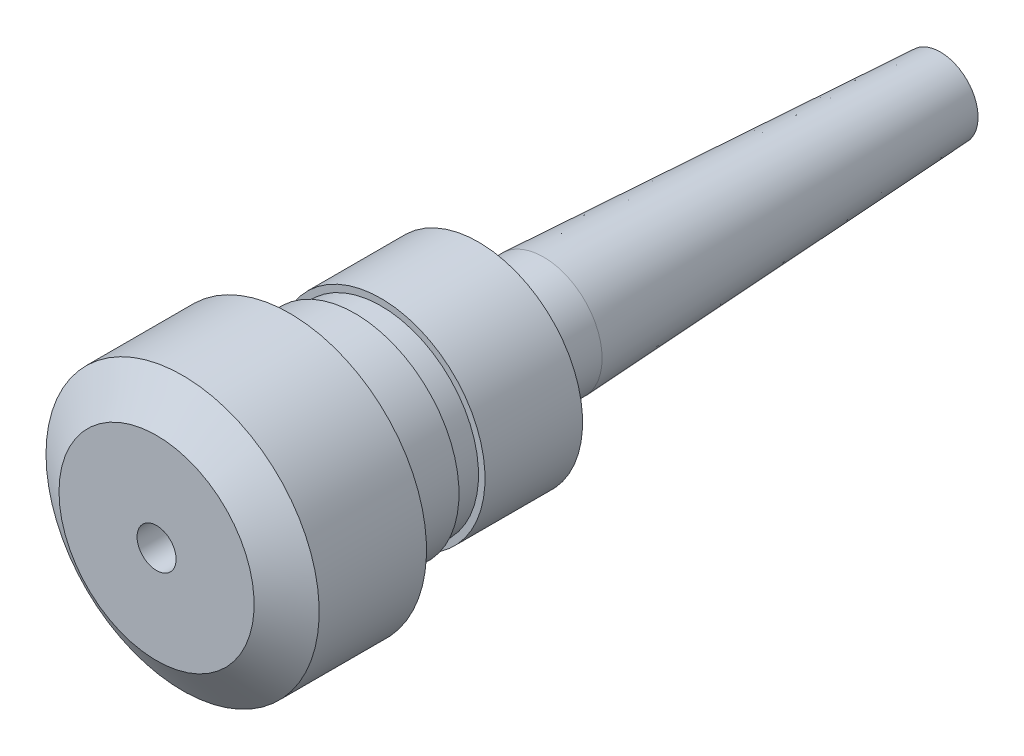
ISO-10303-21;
HEADER;
FILE_DESCRIPTION(('STEP AP214'),'2;1');
FILE_NAME('part.step','',(''),(''),'','','');
FILE_SCHEMA(('AUTOMOTIVE_DESIGN { 1 0 10303 214 1 1 1 1 }'));
ENDSEC;
DATA;
#1=APPLICATION_CONTEXT('core data for automotive mechanical design processes');
#2=APPLICATION_PROTOCOL_DEFINITION('international standard','automotive_design',2000,#1);
#3=PRODUCT_CONTEXT('',#1,'mechanical');
#4=PRODUCT('Part','Part','',(#3));
#5=PRODUCT_RELATED_PRODUCT_CATEGORY('part','',(#4));
#6=PRODUCT_DEFINITION_FORMATION('','',#4);
#7=PRODUCT_DEFINITION_CONTEXT('part definition',#1,'design');
#8=PRODUCT_DEFINITION('design','',#6,#7);
#9=PRODUCT_DEFINITION_SHAPE('','',#8);
#10=(LENGTH_UNIT() NAMED_UNIT(*) SI_UNIT(.MILLI.,.METRE.));
#11=(NAMED_UNIT(*) PLANE_ANGLE_UNIT() SI_UNIT($,.RADIAN.));
#12=(NAMED_UNIT(*) SI_UNIT($,.STERADIAN.) SOLID_ANGLE_UNIT());
#13=UNCERTAINTY_MEASURE_WITH_UNIT(LENGTH_MEASURE(1.E-05),#10,'distance_accuracy_value','');
#14=(GEOMETRIC_REPRESENTATION_CONTEXT(3) GLOBAL_UNCERTAINTY_ASSIGNED_CONTEXT((#13)) GLOBAL_UNIT_ASSIGNED_CONTEXT((#10,
#11,#12)) REPRESENTATION_CONTEXT('',''));
#15=CARTESIAN_POINT('',(0.,0.,0.));
#16=DIRECTION('',(0.,0.,1.));
#17=DIRECTION('',(1.,0.,0.));
#18=AXIS2_PLACEMENT_3D('',#15,#16,#17);
#19=CARTESIAN_POINT('',(16.,0.,-49.5));
#20=DIRECTION('',(0.,0.,1.));
#21=DIRECTION('',(1.,0.,0.));
#22=AXIS2_PLACEMENT_3D('',#19,#20,#21);
#23=PLANE('',#22);
#24=CARTESIAN_POINT('',(0.,0.,-49.5));
#25=DIRECTION('',(0.,0.,-1.));
#26=DIRECTION('',(-1.,0.,0.));
#27=AXIS2_PLACEMENT_3D('',#24,#25,#26);
#28=CIRCLE('',#27,16.);
#29=CARTESIAN_POINT('',(-16.,0.,-49.5));
#30=VERTEX_POINT('',#29);
#31=EDGE_CURVE('E65',#30,#30,#28,.T.);
#32=ORIENTED_EDGE('',*,*,#31,.T.);
#33=EDGE_LOOP('',(#32));
#34=FACE_BOUND('',#33,.T.);
#35=CARTESIAN_POINT('',(0.,0.,-49.5));
#36=DIRECTION('',(0.,0.,1.));
#37=DIRECTION('',(1.,0.,0.));
#38=AXIS2_PLACEMENT_3D('',#35,#36,#37);
#39=CIRCLE('',#38,9.);
#40=CARTESIAN_POINT('',(9.,0.,-49.5));
#41=VERTEX_POINT('',#40);
#42=EDGE_CURVE('E10',#41,#41,#39,.F.);
#43=ORIENTED_EDGE('',*,*,#42,.F.);
#44=EDGE_LOOP('',(#43));
#45=FACE_BOUND('',#44,.T.);
#46=ADVANCED_FACE('F33',(#34,#45),#23,.F.);
#47=CARTESIAN_POINT('',(0.,0.,0.));
#48=DIRECTION('',(0.,0.,-1.));
#49=DIRECTION('',(-1.,0.,0.));
#50=AXIS2_PLACEMENT_3D('',#47,#48,#49);
#51=CONICAL_SURFACE('',#50,15.,0.982793723247329);
#52=CARTESIAN_POINT('',(0.,0.,-4.));
#53=DIRECTION('',(0.,0.,-1.));
#54=DIRECTION('',(-1.,0.,0.));
#55=AXIS2_PLACEMENT_3D('',#52,#53,#54);
#56=CIRCLE('',#55,21.);
#57=CARTESIAN_POINT('',(-21.,0.,-4.));
#58=VERTEX_POINT('',#57);
#59=EDGE_CURVE('E40',#58,#58,#56,.T.);
#60=ORIENTED_EDGE('',*,*,#59,.F.);
#61=EDGE_LOOP('',(#60));
#62=FACE_BOUND('',#61,.T.);
#63=CARTESIAN_POINT('',(0.,0.,0.));
#64=DIRECTION('',(0.,0.,-1.));
#65=DIRECTION('',(-1.,0.,0.));
#66=AXIS2_PLACEMENT_3D('',#63,#64,#65);
#67=CIRCLE('',#66,15.);
#68=CARTESIAN_POINT('',(-15.,0.,0.));
#69=VERTEX_POINT('',#68);
#70=EDGE_CURVE('E74',#69,#69,#67,.T.);
#71=ORIENTED_EDGE('',*,*,#70,.T.);
#72=EDGE_LOOP('',(#71));
#73=FACE_BOUND('',#72,.T.);
#74=ADVANCED_FACE('F35',(#62,#73),#51,.T.);
#75=CARTESIAN_POINT('',(0.,0.,-75.9090066996326));
#76=DIRECTION('',(0.,0.,-1.));
#77=DIRECTION('',(-1.,0.,0.));
#78=AXIS2_PLACEMENT_3D('',#75,#76,#77);
#79=CYLINDRICAL_SURFACE('',#78,21.);
#80=CARTESIAN_POINT('',(0.,0.,-20.5));
#81=DIRECTION('',(0.,0.,-1.));
#82=DIRECTION('',(-1.,0.,0.));
#83=AXIS2_PLACEMENT_3D('',#80,#81,#82);
#84=CIRCLE('',#83,21.);
#85=CARTESIAN_POINT('',(-21.,0.,-20.5));
#86=VERTEX_POINT('',#85);
#87=EDGE_CURVE('E44',#86,#86,#84,.T.);
#88=ORIENTED_EDGE('',*,*,#87,.F.);
#89=EDGE_LOOP('',(#88));
#90=FACE_BOUND('',#89,.T.);
#91=ORIENTED_EDGE('',*,*,#59,.T.);
#92=EDGE_LOOP('',(#91));
#93=FACE_BOUND('',#92,.T.);
#94=ADVANCED_FACE('F126',(#90,#93),#79,.T.);
#95=CARTESIAN_POINT('',(21.,0.,-20.5));
#96=DIRECTION('',(0.,0.,1.));
#97=DIRECTION('',(1.,0.,0.));
#98=AXIS2_PLACEMENT_3D('',#95,#96,#97);
#99=PLANE('',#98);
#100=CARTESIAN_POINT('',(0.,0.,-20.5));
#101=DIRECTION('',(0.,0.,-1.));
#102=DIRECTION('',(-1.,0.,0.));
#103=AXIS2_PLACEMENT_3D('',#100,#101,#102);
#104=CIRCLE('',#103,16.);
#105=CARTESIAN_POINT('',(-16.,0.,-20.5));
#106=VERTEX_POINT('',#105);
#107=EDGE_CURVE('E48',#106,#106,#104,.T.);
#108=ORIENTED_EDGE('',*,*,#107,.F.);
#109=EDGE_LOOP('',(#108));
#110=FACE_BOUND('',#109,.T.);
#111=ORIENTED_EDGE('',*,*,#87,.T.);
#112=EDGE_LOOP('',(#111));
#113=FACE_BOUND('',#112,.T.);
#114=ADVANCED_FACE('F152',(#110,#113),#99,.F.);
#115=CARTESIAN_POINT('',(0.,0.,-75.9090066996326));
#116=DIRECTION('',(0.,0.,-1.));
#117=DIRECTION('',(-1.,0.,0.));
#118=AXIS2_PLACEMENT_3D('',#115,#116,#117);
#119=CYLINDRICAL_SURFACE('',#118,16.);
#120=CARTESIAN_POINT('',(0.,0.,-30.5));
#121=DIRECTION('',(0.,0.,-1.));
#122=DIRECTION('',(-1.,0.,0.));
#123=AXIS2_PLACEMENT_3D('',#120,#121,#122);
#124=CIRCLE('',#123,16.);
#125=CARTESIAN_POINT('',(-16.,0.,-30.5));
#126=VERTEX_POINT('',#125);
#127=EDGE_CURVE('E53',#126,#126,#124,.T.);
#128=ORIENTED_EDGE('',*,*,#127,.F.);
#129=EDGE_LOOP('',(#128));
#130=FACE_BOUND('',#129,.T.);
#131=ORIENTED_EDGE('',*,*,#107,.T.);
#132=EDGE_LOOP('',(#131));
#133=FACE_BOUND('',#132,.T.);
#134=ADVANCED_FACE('F148',(#130,#133),#119,.T.);
#135=CARTESIAN_POINT('',(16.,0.,-30.5));
#136=DIRECTION('',(0.,0.,1.));
#137=DIRECTION('',(1.,0.,0.));
#138=AXIS2_PLACEMENT_3D('',#135,#136,#137);
#139=PLANE('',#138);
#140=CARTESIAN_POINT('',(0.,0.,-30.5));
#141=DIRECTION('',(0.,0.,-1.));
#142=DIRECTION('',(-1.,0.,0.));
#143=AXIS2_PLACEMENT_3D('',#140,#141,#142);
#144=CIRCLE('',#143,15.);
#145=CARTESIAN_POINT('',(-15.,0.,-30.5));
#146=VERTEX_POINT('',#145);
#147=EDGE_CURVE('E56',#146,#146,#144,.T.);
#148=ORIENTED_EDGE('',*,*,#147,.F.);
#149=EDGE_LOOP('',(#148));
#150=FACE_BOUND('',#149,.T.);
#151=ORIENTED_EDGE('',*,*,#127,.T.);
#152=EDGE_LOOP('',(#151));
#153=FACE_BOUND('',#152,.T.);
#154=ADVANCED_FACE('F144',(#150,#153),#139,.F.);
#155=CARTESIAN_POINT('',(0.,0.,-75.9090066996326));
#156=DIRECTION('',(0.,0.,-1.));
#157=DIRECTION('',(-1.,0.,0.));
#158=AXIS2_PLACEMENT_3D('',#155,#156,#157);
#159=CYLINDRICAL_SURFACE('',#158,15.);
#160=CARTESIAN_POINT('',(0.,0.,-34.5));
#161=DIRECTION('',(0.,0.,-1.));
#162=DIRECTION('',(-1.,0.,0.));
#163=AXIS2_PLACEMENT_3D('',#160,#161,#162);
#164=CIRCLE('',#163,15.);
#165=CARTESIAN_POINT('',(-15.,0.,-34.5));
#166=VERTEX_POINT('',#165);
#167=EDGE_CURVE('E59',#166,#166,#164,.T.);
#168=ORIENTED_EDGE('',*,*,#167,.F.);
#169=EDGE_LOOP('',(#168));
#170=FACE_BOUND('',#169,.T.);
#171=ORIENTED_EDGE('',*,*,#147,.T.);
#172=EDGE_LOOP('',(#171));
#173=FACE_BOUND('',#172,.T.);
#174=ADVANCED_FACE('F140',(#170,#173),#159,.T.);
#175=CARTESIAN_POINT('',(15.,0.,-34.5));
#176=DIRECTION('',(0.,0.,-1.));
#177=DIRECTION('',(-1.,0.,0.));
#178=AXIS2_PLACEMENT_3D('',#175,#176,#177);
#179=PLANE('',#178);
#180=CARTESIAN_POINT('',(0.,0.,-34.5));
#181=DIRECTION('',(0.,0.,-1.));
#182=DIRECTION('',(-1.,0.,0.));
#183=AXIS2_PLACEMENT_3D('',#180,#181,#182);
#184=CIRCLE('',#183,16.);
#185=CARTESIAN_POINT('',(-16.,0.,-34.5));
#186=VERTEX_POINT('',#185);
#187=EDGE_CURVE('E62',#186,#186,#184,.T.);
#188=ORIENTED_EDGE('',*,*,#187,.F.);
#189=EDGE_LOOP('',(#188));
#190=FACE_BOUND('',#189,.T.);
#191=ORIENTED_EDGE('',*,*,#167,.T.);
#192=EDGE_LOOP('',(#191));
#193=FACE_BOUND('',#192,.T.);
#194=ADVANCED_FACE('F136',(#190,#193),#179,.F.);
#195=CARTESIAN_POINT('',(0.,0.,-75.9090066996326));
#196=DIRECTION('',(0.,0.,-1.));
#197=DIRECTION('',(-1.,0.,0.));
#198=AXIS2_PLACEMENT_3D('',#195,#196,#197);
#199=CYLINDRICAL_SURFACE('',#198,16.);
#200=ORIENTED_EDGE('',*,*,#31,.F.);
#201=EDGE_LOOP('',(#200));
#202=FACE_BOUND('',#201,.T.);
#203=ORIENTED_EDGE('',*,*,#187,.T.);
#204=EDGE_LOOP('',(#203));
#205=FACE_BOUND('',#204,.T.);
#206=ADVANCED_FACE('F133',(#202,#205),#199,.T.);
#207=CARTESIAN_POINT('',(3.00000000000001,0.,-30.));
#208=DIRECTION('',(0.,0.,-1.));
#209=DIRECTION('',(-1.,0.,0.));
#210=AXIS2_PLACEMENT_3D('',#207,#208,#209);
#211=PLANE('',#210);
#212=CARTESIAN_POINT('',(0.,0.,-30.));
#213=DIRECTION('',(0.,0.,-1.));
#214=DIRECTION('',(-1.,0.,0.));
#215=AXIS2_PLACEMENT_3D('',#212,#213,#214);
#216=CIRCLE('',#215,3.00000000000001);
#217=CARTESIAN_POINT('',(-3.00000000000001,0.,-30.));
#218=VERTEX_POINT('',#217);
#219=EDGE_CURVE('E68',#218,#218,#216,.T.);
#220=ORIENTED_EDGE('',*,*,#219,.F.);
#221=EDGE_LOOP('',(#220));
#222=FACE_BOUND('',#221,.T.);
#223=ADVANCED_FACE('F131',(#222),#211,.F.);
#224=CARTESIAN_POINT('',(0.,0.,-75.9090066996326));
#225=DIRECTION('',(0.,0.,-1.));
#226=DIRECTION('',(-1.,0.,0.));
#227=AXIS2_PLACEMENT_3D('',#224,#225,#226);
#228=CYLINDRICAL_SURFACE('',#227,3.00000000000001);
#229=CARTESIAN_POINT('',(0.,0.,0.));
#230=DIRECTION('',(0.,0.,-1.));
#231=DIRECTION('',(-1.,0.,0.));
#232=AXIS2_PLACEMENT_3D('',#229,#230,#231);
#233=CIRCLE('',#232,3.00000000000001);
#234=CARTESIAN_POINT('',(-3.00000000000001,0.,0.));
#235=VERTEX_POINT('',#234);
#236=EDGE_CURVE('E71',#235,#235,#233,.T.);
#237=ORIENTED_EDGE('',*,*,#236,.F.);
#238=EDGE_LOOP('',(#237));
#239=FACE_BOUND('',#238,.T.);
#240=ORIENTED_EDGE('',*,*,#219,.T.);
#241=EDGE_LOOP('',(#240));
#242=FACE_BOUND('',#241,.T.);
#243=ADVANCED_FACE('F117',(#239,#242),#228,.F.);
#244=CARTESIAN_POINT('',(3.00000000000001,0.,0.));
#245=DIRECTION('',(0.,0.,-1.));
#246=DIRECTION('',(-1.,0.,0.));
#247=AXIS2_PLACEMENT_3D('',#244,#245,#246);
#248=PLANE('',#247);
#249=ORIENTED_EDGE('',*,*,#70,.F.);
#250=EDGE_LOOP('',(#249));
#251=FACE_BOUND('',#250,.T.);
#252=ORIENTED_EDGE('',*,*,#236,.T.);
#253=EDGE_LOOP('',(#252));
#254=FACE_BOUND('',#253,.T.);
#255=ADVANCED_FACE('F112',(#251,#254),#248,.F.);
#256=CARTESIAN_POINT('',(0.,0.,-59.5));
#257=DIRECTION('',(0.,0.,1.));
#258=DIRECTION('',(1.,0.,0.));
#259=AXIS2_PLACEMENT_3D('',#256,#257,#258);
#260=CYLINDRICAL_SURFACE('',#259,9.);
#261=CARTESIAN_POINT('',(0.,0.,-59.5));
#262=DIRECTION('',(0.,0.,-1.));
#263=DIRECTION('',(-1.,0.,0.));
#264=AXIS2_PLACEMENT_3D('',#261,#262,#263);
#265=CIRCLE('',#264,9.);
#266=CARTESIAN_POINT('',(-9.,0.,-59.5));
#267=VERTEX_POINT('',#266);
#268=EDGE_CURVE('E77',#267,#267,#265,.T.);
#269=ORIENTED_EDGE('',*,*,#268,.F.);
#270=EDGE_LOOP('',(#269));
#271=FACE_BOUND('',#270,.T.);
#272=ORIENTED_EDGE('',*,*,#42,.T.);
#273=EDGE_LOOP('',(#272));
#274=FACE_BOUND('',#273,.T.);
#275=ADVANCED_FACE('F107',(#271,#274),#260,.T.);
#276=CARTESIAN_POINT('',(0.,0.,-59.5));
#277=DIRECTION('',(0.,0.,1.));
#278=DIRECTION('',(-1.,0.,0.));
#279=AXIS2_PLACEMENT_3D('',#276,#277,#278);
#280=CONICAL_SURFACE('',#279,9.,0.0523598775598299);
#281=CARTESIAN_POINT('',(0.,0.,-120.5));
#282=DIRECTION('',(0.,0.,-1.));
#283=DIRECTION('',(-1.,0.,0.));
#284=AXIS2_PLACEMENT_3D('',#281,#282,#283);
#285=CIRCLE('',#284,5.80312546373448);
#286=CARTESIAN_POINT('',(-5.80312546373448,0.,-120.5));
#287=VERTEX_POINT('',#286);
#288=EDGE_CURVE('E80',#287,#287,#285,.T.);
#289=ORIENTED_EDGE('',*,*,#288,.F.);
#290=EDGE_LOOP('',(#289));
#291=FACE_BOUND('',#290,.T.);
#292=ORIENTED_EDGE('',*,*,#268,.T.);
#293=EDGE_LOOP('',(#292));
#294=FACE_BOUND('',#293,.T.);
#295=ADVANCED_FACE('F101',(#291,#294),#280,.T.);
#296=CARTESIAN_POINT('',(0.,0.,-120.5));
#297=DIRECTION('',(0.,0.,-1.));
#298=DIRECTION('',(-1.,0.,0.));
#299=AXIS2_PLACEMENT_3D('',#296,#297,#298);
#300=PLANE('',#299);
#301=CARTESIAN_POINT('',(0.,0.,-120.5));
#302=DIRECTION('',(0.,0.,-1.));
#303=DIRECTION('',(-1.,0.,0.));
#304=AXIS2_PLACEMENT_3D('',#301,#302,#303);
#305=CIRCLE('',#304,4.);
#306=CARTESIAN_POINT('',(-4.,0.,-120.5));
#307=VERTEX_POINT('',#306);
#308=EDGE_CURVE('E84',#307,#307,#305,.T.);
#309=ORIENTED_EDGE('',*,*,#308,.F.);
#310=EDGE_LOOP('',(#309));
#311=FACE_BOUND('',#310,.T.);
#312=ORIENTED_EDGE('',*,*,#288,.T.);
#313=EDGE_LOOP('',(#312));
#314=FACE_BOUND('',#313,.T.);
#315=ADVANCED_FACE('F95',(#311,#314),#300,.T.);
#316=CARTESIAN_POINT('',(0.,0.,-59.5));
#317=DIRECTION('',(0.,0.,-1.));
#318=DIRECTION('',(-1.,0.,0.));
#319=AXIS2_PLACEMENT_3D('',#316,#317,#318);
#320=CYLINDRICAL_SURFACE('',#319,4.);
#321=CARTESIAN_POINT('',(0.,0.,-59.5));
#322=DIRECTION('',(0.,0.,-1.));
#323=DIRECTION('',(-1.,0.,0.));
#324=AXIS2_PLACEMENT_3D('',#321,#322,#323);
#325=CIRCLE('',#324,4.);
#326=CARTESIAN_POINT('',(-4.,0.,-59.5));
#327=VERTEX_POINT('',#326);
#328=EDGE_CURVE('E83',#327,#327,#325,.T.);
#329=ORIENTED_EDGE('',*,*,#328,.F.);
#330=EDGE_LOOP('',(#329));
#331=FACE_BOUND('',#330,.T.);
#332=ORIENTED_EDGE('',*,*,#308,.T.);
#333=EDGE_LOOP('',(#332));
#334=FACE_BOUND('',#333,.T.);
#335=ADVANCED_FACE('F92',(#331,#334),#320,.F.);
#336=CARTESIAN_POINT('',(0.,0.,-59.5));
#337=DIRECTION('',(0.,0.,-1.));
#338=DIRECTION('',(-1.,0.,0.));
#339=AXIS2_PLACEMENT_3D('',#336,#337,#338);
#340=PLANE('',#339);
#341=ORIENTED_EDGE('',*,*,#328,.T.);
#342=EDGE_LOOP('',(#341));
#343=FACE_BOUND('',#342,.T.);
#344=ADVANCED_FACE('F90',(#343),#340,.T.);
#345=CLOSED_SHELL('',(#46,#74,#94,#114,#134,#154,#174,#194,#206,#223,#243,#255,#275,#295,#315,
#335,#344));
#346=MANIFOLD_SOLID_BREP('B2',#345);
#347=ADVANCED_BREP_SHAPE_REPRESENTATION('',(#18,#346),#14);
#348=SHAPE_DEFINITION_REPRESENTATION(#9,#347);
ENDSEC;
END-ISO-10303-21;
